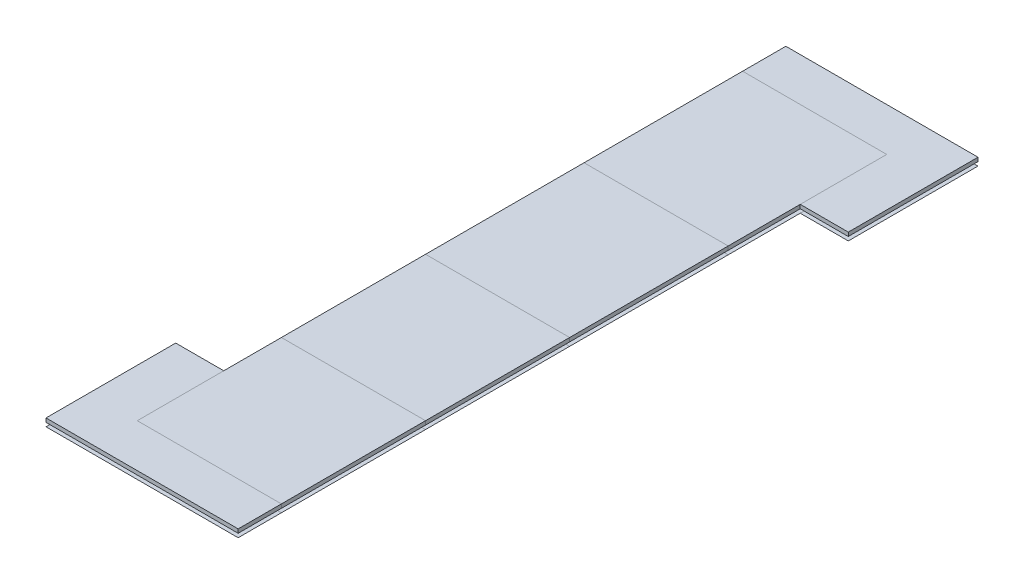
ISO-10303-21;
HEADER;
FILE_DESCRIPTION(('STEP AP214'),'2;1');
FILE_NAME('part.step','',(''),(''),'','','');
FILE_SCHEMA(('AUTOMOTIVE_DESIGN { 1 0 10303 214 1 1 1 1 }'));
ENDSEC;
DATA;
#1=APPLICATION_CONTEXT('core data for automotive mechanical design processes');
#2=APPLICATION_PROTOCOL_DEFINITION('international standard','automotive_design',2000,#1);
#3=PRODUCT_CONTEXT('',#1,'mechanical');
#4=PRODUCT('Part','Part','',(#3));
#5=PRODUCT_RELATED_PRODUCT_CATEGORY('part','',(#4));
#6=PRODUCT_DEFINITION_FORMATION('','',#4);
#7=PRODUCT_DEFINITION_CONTEXT('part definition',#1,'design');
#8=PRODUCT_DEFINITION('design','',#6,#7);
#9=PRODUCT_DEFINITION_SHAPE('','',#8);
#10=(LENGTH_UNIT() NAMED_UNIT(*) SI_UNIT(.MILLI.,.METRE.));
#11=(NAMED_UNIT(*) PLANE_ANGLE_UNIT() SI_UNIT($,.RADIAN.));
#12=(NAMED_UNIT(*) SI_UNIT($,.STERADIAN.) SOLID_ANGLE_UNIT());
#13=UNCERTAINTY_MEASURE_WITH_UNIT(LENGTH_MEASURE(1.E-05),#10,'distance_accuracy_value','');
#14=(GEOMETRIC_REPRESENTATION_CONTEXT(3) GLOBAL_UNCERTAINTY_ASSIGNED_CONTEXT((#13)) GLOBAL_UNIT_ASSIGNED_CONTEXT((#10,
#11,#12)) REPRESENTATION_CONTEXT('',''));
#15=CARTESIAN_POINT('',(0.,0.,0.));
#16=DIRECTION('',(0.,0.,1.));
#17=DIRECTION('',(1.,0.,0.));
#18=AXIS2_PLACEMENT_3D('',#15,#16,#17);
#19=CARTESIAN_POINT('',(50.,4.,0.));
#20=DIRECTION('',(-1.,0.,0.));
#21=DIRECTION('',(0.,0.,1.));
#22=AXIS2_PLACEMENT_3D('',#19,#20,#21);
#23=PLANE('',#22);
#24=DIRECTION('',(0.,1.,0.));
#25=VECTOR('',#24,1.);
#26=CARTESIAN_POINT('',(50.,4.,-510.));
#27=LINE('',#26,#25);
#28=CARTESIAN_POINT('',(50.,4.,-510.));
#29=VERTEX_POINT('',#28);
#30=CARTESIAN_POINT('',(50.,8.,-510.));
#31=VERTEX_POINT('',#30);
#32=EDGE_CURVE('E12',#29,#31,#27,.T.);
#33=ORIENTED_EDGE('',*,*,#32,.F.);
#34=DIRECTION('',(0.,0.,1.));
#35=VECTOR('',#34,1.);
#36=CARTESIAN_POINT('',(50.,4.,0.));
#37=LINE('',#36,#35);
#38=CARTESIAN_POINT('',(50.,4.,-345.));
#39=VERTEX_POINT('',#38);
#40=EDGE_CURVE('E104',#29,#39,#37,.T.);
#41=ORIENTED_EDGE('',*,*,#40,.T.);
#42=DIRECTION('',(0.,1.,0.));
#43=VECTOR('',#42,1.);
#44=CARTESIAN_POINT('',(50.,4.,-345.));
#45=LINE('',#44,#43);
#46=CARTESIAN_POINT('',(50.,8.,-345.));
#47=VERTEX_POINT('',#46);
#48=EDGE_CURVE('E59',#39,#47,#45,.T.);
#49=ORIENTED_EDGE('',*,*,#48,.T.);
#50=DIRECTION('',(0.,0.,1.));
#51=VECTOR('',#50,1.);
#52=CARTESIAN_POINT('',(50.,8.,0.));
#53=LINE('',#52,#51);
#54=EDGE_CURVE('E117',#31,#47,#53,.T.);
#55=ORIENTED_EDGE('',*,*,#54,.F.);
#56=EDGE_LOOP('',(#33,#41,#49,#55));
#57=FACE_BOUND('',#56,.T.);
#58=ADVANCED_FACE('F49',(#57),#23,.T.);
#59=CARTESIAN_POINT('',(0.,4.,-345.));
#60=DIRECTION('',(0.,0.,1.));
#61=DIRECTION('',(1.,0.,0.));
#62=AXIS2_PLACEMENT_3D('',#59,#60,#61);
#63=PLANE('',#62);
#64=ORIENTED_EDGE('',*,*,#48,.F.);
#65=DIRECTION('',(1.,0.,0.));
#66=VECTOR('',#65,1.);
#67=CARTESIAN_POINT('',(0.,4.,-345.));
#68=LINE('',#67,#66);
#69=CARTESIAN_POINT('',(200.,4.,-345.));
#70=VERTEX_POINT('',#69);
#71=EDGE_CURVE('E111',#70,#39,#68,.F.);
#72=ORIENTED_EDGE('',*,*,#71,.F.);
#73=DIRECTION('',(0.,1.,0.));
#74=VECTOR('',#73,1.);
#75=CARTESIAN_POINT('',(200.,4.,-345.));
#76=LINE('',#75,#74);
#77=CARTESIAN_POINT('',(200.,8.,-345.));
#78=VERTEX_POINT('',#77);
#79=EDGE_CURVE('E67',#70,#78,#76,.T.);
#80=ORIENTED_EDGE('',*,*,#79,.T.);
#81=DIRECTION('',(1.,0.,0.));
#82=VECTOR('',#81,1.);
#83=CARTESIAN_POINT('',(0.,8.,-345.));
#84=LINE('',#83,#82);
#85=EDGE_CURVE('E98',#78,#47,#84,.F.);
#86=ORIENTED_EDGE('',*,*,#85,.T.);
#87=EDGE_LOOP('',(#64,#72,#80,#86));
#88=FACE_BOUND('',#87,.T.);
#89=ADVANCED_FACE('F121',(#88),#63,.T.);
#90=CARTESIAN_POINT('',(200.,4.,0.));
#91=DIRECTION('',(-1.,0.,0.));
#92=DIRECTION('',(0.,0.,1.));
#93=AXIS2_PLACEMENT_3D('',#90,#91,#92);
#94=PLANE('',#93);
#95=ORIENTED_EDGE('',*,*,#79,.F.);
#96=DIRECTION('',(0.,0.,1.));
#97=VECTOR('',#96,1.);
#98=CARTESIAN_POINT('',(200.,4.,0.));
#99=LINE('',#98,#97);
#100=CARTESIAN_POINT('',(200.,4.,-510.));
#101=VERTEX_POINT('',#100);
#102=EDGE_CURVE('E103',#70,#101,#99,.F.);
#103=ORIENTED_EDGE('',*,*,#102,.T.);
#104=DIRECTION('',(0.,1.,0.));
#105=VECTOR('',#104,1.);
#106=CARTESIAN_POINT('',(200.,4.,-510.));
#107=LINE('',#106,#105);
#108=CARTESIAN_POINT('',(200.,8.,-510.));
#109=VERTEX_POINT('',#108);
#110=EDGE_CURVE('E53',#101,#109,#107,.T.);
#111=ORIENTED_EDGE('',*,*,#110,.T.);
#112=DIRECTION('',(0.,0.,1.));
#113=VECTOR('',#112,1.);
#114=CARTESIAN_POINT('',(200.,8.,0.));
#115=LINE('',#114,#113);
#116=EDGE_CURVE('E113',#78,#109,#115,.F.);
#117=ORIENTED_EDGE('',*,*,#116,.F.);
#118=EDGE_LOOP('',(#95,#103,#111,#117));
#119=FACE_BOUND('',#118,.T.);
#120=ADVANCED_FACE('F106',(#119),#94,.F.);
#121=CARTESIAN_POINT('',(0.,4.,-510.));
#122=DIRECTION('',(0.,0.,1.));
#123=DIRECTION('',(1.,0.,0.));
#124=AXIS2_PLACEMENT_3D('',#121,#122,#123);
#125=PLANE('',#124);
#126=DIRECTION('',(1.,0.,0.));
#127=VECTOR('',#126,1.);
#128=CARTESIAN_POINT('',(0.,4.,-510.));
#129=LINE('',#128,#127);
#130=EDGE_CURVE('E92',#101,#29,#129,.F.);
#131=ORIENTED_EDGE('',*,*,#130,.T.);
#132=ORIENTED_EDGE('',*,*,#32,.T.);
#133=DIRECTION('',(1.,0.,0.));
#134=VECTOR('',#133,1.);
#135=CARTESIAN_POINT('',(0.,8.,-510.));
#136=LINE('',#135,#134);
#137=EDGE_CURVE('E94',#109,#31,#136,.F.);
#138=ORIENTED_EDGE('',*,*,#137,.F.);
#139=ORIENTED_EDGE('',*,*,#110,.F.);
#140=EDGE_LOOP('',(#131,#132,#138,#139));
#141=FACE_BOUND('',#140,.T.);
#142=ADVANCED_FACE('F51',(#141),#125,.F.);
#143=CARTESIAN_POINT('',(0.,8.,0.));
#144=DIRECTION('',(0.,1.,0.));
#145=DIRECTION('',(0.,0.,1.));
#146=AXIS2_PLACEMENT_3D('',#143,#144,#145);
#147=PLANE('',#146);
#148=ORIENTED_EDGE('',*,*,#116,.T.);
#149=ORIENTED_EDGE('',*,*,#137,.T.);
#150=ORIENTED_EDGE('',*,*,#54,.T.);
#151=ORIENTED_EDGE('',*,*,#85,.F.);
#152=EDGE_LOOP('',(#148,#149,#150,#151));
#153=FACE_BOUND('',#152,.T.);
#154=ADVANCED_FACE('F120',(#153),#147,.T.);
#155=CARTESIAN_POINT('',(0.,4.,0.));
#156=DIRECTION('',(0.,1.,0.));
#157=DIRECTION('',(0.,0.,1.));
#158=AXIS2_PLACEMENT_3D('',#155,#156,#157);
#159=PLANE('',#158);
#160=ORIENTED_EDGE('',*,*,#102,.F.);
#161=ORIENTED_EDGE('',*,*,#71,.T.);
#162=ORIENTED_EDGE('',*,*,#40,.F.);
#163=ORIENTED_EDGE('',*,*,#130,.F.);
#164=EDGE_LOOP('',(#160,#161,#162,#163));
#165=FACE_BOUND('',#164,.T.);
#166=ADVANCED_FACE('F101',(#165),#159,.F.);
#167=CLOSED_SHELL('',(#58,#89,#120,#142,#154,#166));
#168=MANIFOLD_SOLID_BREP('B2',#167);
#169=CARTESIAN_POINT('',(0.,4.,-585.));
#170=DIRECTION('',(0.,0.,1.));
#171=DIRECTION('',(1.,0.,0.));
#172=AXIS2_PLACEMENT_3D('',#169,#170,#171);
#173=PLANE('',#172);
#174=DIRECTION('',(0.,1.,0.));
#175=VECTOR('',#174,1.);
#176=CARTESIAN_POINT('',(200.,4.,-585.));
#177=LINE('',#176,#175);
#178=CARTESIAN_POINT('',(200.,4.,-585.));
#179=VERTEX_POINT('',#178);
#180=CARTESIAN_POINT('',(200.,8.,-585.));
#181=VERTEX_POINT('',#180);
#182=EDGE_CURVE('E47',#179,#181,#177,.T.);
#183=ORIENTED_EDGE('',*,*,#182,.F.);
#184=DIRECTION('',(1.,0.,0.));
#185=VECTOR('',#184,1.);
#186=CARTESIAN_POINT('',(0.,4.,-585.));
#187=LINE('',#186,#185);
#188=CARTESIAN_POINT('',(250.,4.,-585.));
#189=VERTEX_POINT('',#188);
#190=EDGE_CURVE('E250',#179,#189,#187,.T.);
#191=ORIENTED_EDGE('',*,*,#190,.T.);
#192=DIRECTION('',(0.,1.,0.));
#193=VECTOR('',#192,1.);
#194=CARTESIAN_POINT('',(250.,4.,-585.));
#195=LINE('',#194,#193);
#196=CARTESIAN_POINT('',(250.,8.,-585.));
#197=VERTEX_POINT('',#196);
#198=EDGE_CURVE('E192',#189,#197,#195,.T.);
#199=ORIENTED_EDGE('',*,*,#198,.T.);
#200=DIRECTION('',(1.,0.,0.));
#201=VECTOR('',#200,1.);
#202=CARTESIAN_POINT('',(0.,8.,-585.));
#203=LINE('',#202,#201);
#204=EDGE_CURVE('E273',#181,#197,#203,.T.);
#205=ORIENTED_EDGE('',*,*,#204,.F.);
#206=EDGE_LOOP('',(#183,#191,#199,#205));
#207=FACE_BOUND('',#206,.T.);
#208=ADVANCED_FACE('F182',(#207),#173,.T.);
#209=CARTESIAN_POINT('',(250.,4.,0.));
#210=DIRECTION('',(-1.,0.,0.));
#211=DIRECTION('',(0.,0.,1.));
#212=AXIS2_PLACEMENT_3D('',#209,#210,#211);
#213=PLANE('',#212);
#214=ORIENTED_EDGE('',*,*,#198,.F.);
#215=DIRECTION('',(0.,0.,1.));
#216=VECTOR('',#215,1.);
#217=CARTESIAN_POINT('',(250.,4.,0.));
#218=LINE('',#217,#216);
#219=CARTESIAN_POINT('',(250.,4.,-720.));
#220=VERTEX_POINT('',#219);
#221=EDGE_CURVE('E263',#189,#220,#218,.F.);
#222=ORIENTED_EDGE('',*,*,#221,.T.);
#223=DIRECTION('',(0.,1.,0.));
#224=VECTOR('',#223,1.);
#225=CARTESIAN_POINT('',(250.,4.,-720.));
#226=LINE('',#225,#224);
#227=CARTESIAN_POINT('',(250.,8.,-720.));
#228=VERTEX_POINT('',#227);
#229=EDGE_CURVE('E270',#220,#228,#226,.T.);
#230=ORIENTED_EDGE('',*,*,#229,.T.);
#231=DIRECTION('',(0.,0.,1.));
#232=VECTOR('',#231,1.);
#233=CARTESIAN_POINT('',(250.,8.,0.));
#234=LINE('',#233,#232);
#235=EDGE_CURVE('E280',#197,#228,#234,.F.);
#236=ORIENTED_EDGE('',*,*,#235,.F.);
#237=EDGE_LOOP('',(#214,#222,#230,#236));
#238=FACE_BOUND('',#237,.T.);
#239=ADVANCED_FACE('F282',(#238),#213,.F.);
#240=CARTESIAN_POINT('',(0.,4.,-720.));
#241=DIRECTION('',(0.,0.,1.));
#242=DIRECTION('',(1.,0.,0.));
#243=AXIS2_PLACEMENT_3D('',#240,#241,#242);
#244=PLANE('',#243);
#245=ORIENTED_EDGE('',*,*,#229,.F.);
#246=DIRECTION('',(1.,0.,0.));
#247=VECTOR('',#246,1.);
#248=CARTESIAN_POINT('',(0.,4.,-720.));
#249=LINE('',#248,#247);
#250=CARTESIAN_POINT('',(50.0000000000001,4.,-720.));
#251=VERTEX_POINT('',#250);
#252=EDGE_CURVE('E260',#220,#251,#249,.F.);
#253=ORIENTED_EDGE('',*,*,#252,.T.);
#254=DIRECTION('',(0.,1.,0.));
#255=VECTOR('',#254,1.);
#256=CARTESIAN_POINT('',(50.0000000000001,4.,-720.));
#257=LINE('',#256,#255);
#258=CARTESIAN_POINT('',(50.0000000000001,8.,-720.));
#259=VERTEX_POINT('',#258);
#260=EDGE_CURVE('E268',#251,#259,#257,.T.);
#261=ORIENTED_EDGE('',*,*,#260,.T.);
#262=DIRECTION('',(1.,0.,0.));
#263=VECTOR('',#262,1.);
#264=CARTESIAN_POINT('',(0.,8.,-720.));
#265=LINE('',#264,#263);
#266=EDGE_CURVE('E283',#228,#259,#265,.F.);
#267=ORIENTED_EDGE('',*,*,#266,.F.);
#268=EDGE_LOOP('',(#245,#253,#261,#267));
#269=FACE_BOUND('',#268,.T.);
#270=ADVANCED_FACE('F292',(#269),#244,.F.);
#271=CARTESIAN_POINT('',(50.0000000000001,4.,0.));
#272=DIRECTION('',(-1.,0.,0.));
#273=DIRECTION('',(0.,0.,1.));
#274=AXIS2_PLACEMENT_3D('',#271,#272,#273);
#275=PLANE('',#274);
#276=ORIENTED_EDGE('',*,*,#260,.F.);
#277=DIRECTION('',(0.,0.,1.));
#278=VECTOR('',#277,1.);
#279=CARTESIAN_POINT('',(50.0000000000001,4.,0.));
#280=LINE('',#279,#278);
#281=CARTESIAN_POINT('',(50.0000000000001,4.,-675.));
#282=VERTEX_POINT('',#281);
#283=EDGE_CURVE('E257',#251,#282,#280,.T.);
#284=ORIENTED_EDGE('',*,*,#283,.T.);
#285=DIRECTION('',(0.,1.,0.));
#286=VECTOR('',#285,1.);
#287=CARTESIAN_POINT('',(50.0000000000001,4.,-675.));
#288=LINE('',#287,#286);
#289=CARTESIAN_POINT('',(50.0000000000001,8.,-675.));
#290=VERTEX_POINT('',#289);
#291=EDGE_CURVE('E200',#282,#290,#288,.T.);
#292=ORIENTED_EDGE('',*,*,#291,.T.);
#293=DIRECTION('',(0.,0.,1.));
#294=VECTOR('',#293,1.);
#295=CARTESIAN_POINT('',(50.0000000000001,8.,0.));
#296=LINE('',#295,#294);
#297=EDGE_CURVE('E243',#259,#290,#296,.T.);
#298=ORIENTED_EDGE('',*,*,#297,.F.);
#299=EDGE_LOOP('',(#276,#284,#292,#298));
#300=FACE_BOUND('',#299,.T.);
#301=ADVANCED_FACE('F289',(#300),#275,.T.);
#302=CARTESIAN_POINT('',(0.,4.,-675.));
#303=DIRECTION('',(0.,0.,1.));
#304=DIRECTION('',(1.,0.,0.));
#305=AXIS2_PLACEMENT_3D('',#302,#303,#304);
#306=PLANE('',#305);
#307=ORIENTED_EDGE('',*,*,#291,.F.);
#308=DIRECTION('',(1.,0.,0.));
#309=VECTOR('',#308,1.);
#310=CARTESIAN_POINT('',(0.,4.,-675.));
#311=LINE('',#310,#309);
#312=CARTESIAN_POINT('',(200.,4.,-675.));
#313=VERTEX_POINT('',#312);
#314=EDGE_CURVE('E248',#282,#313,#311,.T.);
#315=ORIENTED_EDGE('',*,*,#314,.T.);
#316=DIRECTION('',(0.,1.,0.));
#317=VECTOR('',#316,1.);
#318=CARTESIAN_POINT('',(200.,4.,-675.));
#319=LINE('',#318,#317);
#320=CARTESIAN_POINT('',(200.,8.,-675.));
#321=VERTEX_POINT('',#320);
#322=EDGE_CURVE('E186',#313,#321,#319,.T.);
#323=ORIENTED_EDGE('',*,*,#322,.T.);
#324=DIRECTION('',(1.,0.,0.));
#325=VECTOR('',#324,1.);
#326=CARTESIAN_POINT('',(0.,8.,-675.));
#327=LINE('',#326,#325);
#328=EDGE_CURVE('E259',#290,#321,#327,.T.);
#329=ORIENTED_EDGE('',*,*,#328,.F.);
#330=EDGE_LOOP('',(#307,#315,#323,#329));
#331=FACE_BOUND('',#330,.T.);
#332=ADVANCED_FACE('F252',(#331),#306,.T.);
#333=CARTESIAN_POINT('',(200.,4.,0.));
#334=DIRECTION('',(-1.,0.,0.));
#335=DIRECTION('',(0.,0.,1.));
#336=AXIS2_PLACEMENT_3D('',#333,#334,#335);
#337=PLANE('',#336);
#338=DIRECTION('',(0.,0.,1.));
#339=VECTOR('',#338,1.);
#340=CARTESIAN_POINT('',(200.,4.,0.));
#341=LINE('',#340,#339);
#342=EDGE_CURVE('E237',#313,#179,#341,.T.);
#343=ORIENTED_EDGE('',*,*,#342,.T.);
#344=ORIENTED_EDGE('',*,*,#182,.T.);
#345=DIRECTION('',(0.,0.,1.));
#346=VECTOR('',#345,1.);
#347=CARTESIAN_POINT('',(200.,8.,0.));
#348=LINE('',#347,#346);
#349=EDGE_CURVE('E239',#321,#181,#348,.T.);
#350=ORIENTED_EDGE('',*,*,#349,.F.);
#351=ORIENTED_EDGE('',*,*,#322,.F.);
#352=EDGE_LOOP('',(#343,#344,#350,#351));
#353=FACE_BOUND('',#352,.T.);
#354=ADVANCED_FACE('F184',(#353),#337,.T.);
#355=CARTESIAN_POINT('',(0.,8.,0.));
#356=DIRECTION('',(0.,1.,0.));
#357=DIRECTION('',(0.,0.,1.));
#358=AXIS2_PLACEMENT_3D('',#355,#356,#357);
#359=PLANE('',#358);
#360=ORIENTED_EDGE('',*,*,#328,.T.);
#361=ORIENTED_EDGE('',*,*,#349,.T.);
#362=ORIENTED_EDGE('',*,*,#204,.T.);
#363=ORIENTED_EDGE('',*,*,#235,.T.);
#364=ORIENTED_EDGE('',*,*,#266,.T.);
#365=ORIENTED_EDGE('',*,*,#297,.T.);
#366=EDGE_LOOP('',(#360,#361,#362,#363,#364,#365));
#367=FACE_BOUND('',#366,.T.);
#368=ADVANCED_FACE('F278',(#367),#359,.T.);
#369=CARTESIAN_POINT('',(0.,4.,0.));
#370=DIRECTION('',(0.,1.,0.));
#371=DIRECTION('',(0.,0.,1.));
#372=AXIS2_PLACEMENT_3D('',#369,#370,#371);
#373=PLANE('',#372);
#374=ORIENTED_EDGE('',*,*,#314,.F.);
#375=ORIENTED_EDGE('',*,*,#283,.F.);
#376=ORIENTED_EDGE('',*,*,#252,.F.);
#377=ORIENTED_EDGE('',*,*,#221,.F.);
#378=ORIENTED_EDGE('',*,*,#190,.F.);
#379=ORIENTED_EDGE('',*,*,#342,.F.);
#380=EDGE_LOOP('',(#374,#375,#376,#377,#378,#379));
#381=FACE_BOUND('',#380,.T.);
#382=ADVANCED_FACE('F246',(#381),#373,.F.);
#383=CLOSED_SHELL('',(#208,#239,#270,#301,#332,#354,#368,#382));
#384=MANIFOLD_SOLID_BREP('B6',#383);
#385=CARTESIAN_POINT('',(0.,4.,-135.));
#386=DIRECTION('',(0.,0.,1.));
#387=DIRECTION('',(1.,0.,0.));
#388=AXIS2_PLACEMENT_3D('',#385,#386,#387);
#389=PLANE('',#388);
#390=DIRECTION('',(0.,1.,0.));
#391=VECTOR('',#390,1.);
#392=CARTESIAN_POINT('',(50.,4.,-135.));
#393=LINE('',#392,#391);
#394=CARTESIAN_POINT('',(50.,4.,-135.));
#395=VERTEX_POINT('',#394);
#396=CARTESIAN_POINT('',(50.,8.,-135.));
#397=VERTEX_POINT('',#396);
#398=EDGE_CURVE('E180',#395,#397,#393,.T.);
#399=ORIENTED_EDGE('',*,*,#398,.F.);
#400=DIRECTION('',(1.,0.,0.));
#401=VECTOR('',#400,1.);
#402=CARTESIAN_POINT('',(0.,4.,-135.));
#403=LINE('',#402,#401);
#404=CARTESIAN_POINT('',(0.,4.,-135.));
#405=VERTEX_POINT('',#404);
#406=EDGE_CURVE('E435',#395,#405,#403,.F.);
#407=ORIENTED_EDGE('',*,*,#406,.T.);
#408=DIRECTION('',(0.,1.,0.));
#409=VECTOR('',#408,1.);
#410=CARTESIAN_POINT('',(0.,4.,-135.));
#411=LINE('',#410,#409);
#412=CARTESIAN_POINT('',(0.,8.,-135.));
#413=VERTEX_POINT('',#412);
#414=EDGE_CURVE('E377',#405,#413,#411,.T.);
#415=ORIENTED_EDGE('',*,*,#414,.T.);
#416=DIRECTION('',(1.,0.,0.));
#417=VECTOR('',#416,1.);
#418=CARTESIAN_POINT('',(0.,8.,-135.));
#419=LINE('',#418,#417);
#420=EDGE_CURVE('E458',#397,#413,#419,.F.);
#421=ORIENTED_EDGE('',*,*,#420,.F.);
#422=EDGE_LOOP('',(#399,#407,#415,#421));
#423=FACE_BOUND('',#422,.T.);
#424=ADVANCED_FACE('F367',(#423),#389,.F.);
#425=CARTESIAN_POINT('',(0.,4.,0.));
#426=DIRECTION('',(-1.,0.,0.));
#427=DIRECTION('',(0.,0.,1.));
#428=AXIS2_PLACEMENT_3D('',#425,#426,#427);
#429=PLANE('',#428);
#430=ORIENTED_EDGE('',*,*,#414,.F.);
#431=DIRECTION('',(0.,0.,1.));
#432=VECTOR('',#431,1.);
#433=CARTESIAN_POINT('',(0.,4.,0.));
#434=LINE('',#433,#432);
#435=CARTESIAN_POINT('',(0.,4.,0.));
#436=VERTEX_POINT('',#435);
#437=EDGE_CURVE('E448',#405,#436,#434,.T.);
#438=ORIENTED_EDGE('',*,*,#437,.T.);
#439=DIRECTION('',(0.,1.,0.));
#440=VECTOR('',#439,1.);
#441=CARTESIAN_POINT('',(0.,4.,0.));
#442=LINE('',#441,#440);
#443=CARTESIAN_POINT('',(0.,8.,0.));
#444=VERTEX_POINT('',#443);
#445=EDGE_CURVE('E455',#436,#444,#442,.T.);
#446=ORIENTED_EDGE('',*,*,#445,.T.);
#447=DIRECTION('',(0.,0.,1.));
#448=VECTOR('',#447,1.);
#449=CARTESIAN_POINT('',(0.,8.,0.));
#450=LINE('',#449,#448);
#451=EDGE_CURVE('E465',#413,#444,#450,.T.);
#452=ORIENTED_EDGE('',*,*,#451,.F.);
#453=EDGE_LOOP('',(#430,#438,#446,#452));
#454=FACE_BOUND('',#453,.T.);
#455=ADVANCED_FACE('F467',(#454),#429,.T.);
#456=CARTESIAN_POINT('',(0.,4.,0.));
#457=DIRECTION('',(0.,0.,1.));
#458=DIRECTION('',(1.,0.,0.));
#459=AXIS2_PLACEMENT_3D('',#456,#457,#458);
#460=PLANE('',#459);
#461=ORIENTED_EDGE('',*,*,#445,.F.);
#462=DIRECTION('',(1.,0.,0.));
#463=VECTOR('',#462,1.);
#464=CARTESIAN_POINT('',(0.,4.,0.));
#465=LINE('',#464,#463);
#466=CARTESIAN_POINT('',(200.,4.,0.));
#467=VERTEX_POINT('',#466);
#468=EDGE_CURVE('E445',#436,#467,#465,.T.);
#469=ORIENTED_EDGE('',*,*,#468,.T.);
#470=DIRECTION('',(0.,1.,0.));
#471=VECTOR('',#470,1.);
#472=CARTESIAN_POINT('',(200.,4.,0.));
#473=LINE('',#472,#471);
#474=CARTESIAN_POINT('',(200.,8.,0.));
#475=VERTEX_POINT('',#474);
#476=EDGE_CURVE('E453',#467,#475,#473,.T.);
#477=ORIENTED_EDGE('',*,*,#476,.T.);
#478=DIRECTION('',(1.,0.,0.));
#479=VECTOR('',#478,1.);
#480=CARTESIAN_POINT('',(0.,8.,0.));
#481=LINE('',#480,#479);
#482=EDGE_CURVE('E468',#444,#475,#481,.T.);
#483=ORIENTED_EDGE('',*,*,#482,.F.);
#484=EDGE_LOOP('',(#461,#469,#477,#483));
#485=FACE_BOUND('',#484,.T.);
#486=ADVANCED_FACE('F477',(#485),#460,.T.);
#487=CARTESIAN_POINT('',(200.,4.,0.));
#488=DIRECTION('',(-1.,0.,0.));
#489=DIRECTION('',(0.,0.,1.));
#490=AXIS2_PLACEMENT_3D('',#487,#488,#489);
#491=PLANE('',#490);
#492=ORIENTED_EDGE('',*,*,#476,.F.);
#493=DIRECTION('',(0.,0.,1.));
#494=VECTOR('',#493,1.);
#495=CARTESIAN_POINT('',(200.,4.,0.));
#496=LINE('',#495,#494);
#497=CARTESIAN_POINT('',(200.,4.,-45.0000000000001));
#498=VERTEX_POINT('',#497);
#499=EDGE_CURVE('E442',#467,#498,#496,.F.);
#500=ORIENTED_EDGE('',*,*,#499,.T.);
#501=DIRECTION('',(0.,1.,0.));
#502=VECTOR('',#501,1.);
#503=CARTESIAN_POINT('',(200.,4.,-45.0000000000001));
#504=LINE('',#503,#502);
#505=CARTESIAN_POINT('',(200.,8.,-45.0000000000001));
#506=VERTEX_POINT('',#505);
#507=EDGE_CURVE('E385',#498,#506,#504,.T.);
#508=ORIENTED_EDGE('',*,*,#507,.T.);
#509=DIRECTION('',(0.,0.,1.));
#510=VECTOR('',#509,1.);
#511=CARTESIAN_POINT('',(200.,8.,0.));
#512=LINE('',#511,#510);
#513=EDGE_CURVE('E428',#475,#506,#512,.F.);
#514=ORIENTED_EDGE('',*,*,#513,.F.);
#515=EDGE_LOOP('',(#492,#500,#508,#514));
#516=FACE_BOUND('',#515,.T.);
#517=ADVANCED_FACE('F474',(#516),#491,.F.);
#518=CARTESIAN_POINT('',(0.,4.,-45.0000000000001));
#519=DIRECTION('',(0.,0.,1.));
#520=DIRECTION('',(1.,0.,0.));
#521=AXIS2_PLACEMENT_3D('',#518,#519,#520);
#522=PLANE('',#521);
#523=ORIENTED_EDGE('',*,*,#507,.F.);
#524=DIRECTION('',(1.,0.,0.));
#525=VECTOR('',#524,1.);
#526=CARTESIAN_POINT('',(0.,4.,-45.0000000000001));
#527=LINE('',#526,#525);
#528=CARTESIAN_POINT('',(50.0000000000001,4.,-45.0000000000001));
#529=VERTEX_POINT('',#528);
#530=EDGE_CURVE('E433',#498,#529,#527,.F.);
#531=ORIENTED_EDGE('',*,*,#530,.T.);
#532=DIRECTION('',(0.,1.,0.));
#533=VECTOR('',#532,1.);
#534=CARTESIAN_POINT('',(50.0000000000001,4.,-45.0000000000001));
#535=LINE('',#534,#533);
#536=CARTESIAN_POINT('',(50.0000000000001,8.,-45.0000000000001));
#537=VERTEX_POINT('',#536);
#538=EDGE_CURVE('E371',#529,#537,#535,.T.);
#539=ORIENTED_EDGE('',*,*,#538,.T.);
#540=DIRECTION('',(1.,0.,0.));
#541=VECTOR('',#540,1.);
#542=CARTESIAN_POINT('',(0.,8.,-45.0000000000001));
#543=LINE('',#542,#541);
#544=EDGE_CURVE('E444',#506,#537,#543,.F.);
#545=ORIENTED_EDGE('',*,*,#544,.F.);
#546=EDGE_LOOP('',(#523,#531,#539,#545));
#547=FACE_BOUND('',#546,.T.);
#548=ADVANCED_FACE('F437',(#547),#522,.F.);
#549=CARTESIAN_POINT('',(50.0000000000001,4.,0.));
#550=DIRECTION('',(-1.,0.,0.));
#551=DIRECTION('',(0.,0.,1.));
#552=AXIS2_PLACEMENT_3D('',#549,#550,#551);
#553=PLANE('',#552);
#554=DIRECTION('',(0.,0.,1.));
#555=VECTOR('',#554,1.);
#556=CARTESIAN_POINT('',(50.0000000000001,4.,0.));
#557=LINE('',#556,#555);
#558=EDGE_CURVE('E422',#529,#395,#557,.F.);
#559=ORIENTED_EDGE('',*,*,#558,.T.);
#560=ORIENTED_EDGE('',*,*,#398,.T.);
#561=DIRECTION('',(0.,0.,1.));
#562=VECTOR('',#561,1.);
#563=CARTESIAN_POINT('',(50.0000000000001,8.,0.));
#564=LINE('',#563,#562);
#565=EDGE_CURVE('E424',#537,#397,#564,.F.);
#566=ORIENTED_EDGE('',*,*,#565,.F.);
#567=ORIENTED_EDGE('',*,*,#538,.F.);
#568=EDGE_LOOP('',(#559,#560,#566,#567));
#569=FACE_BOUND('',#568,.T.);
#570=ADVANCED_FACE('F369',(#569),#553,.F.);
#571=CARTESIAN_POINT('',(0.,8.,0.));
#572=DIRECTION('',(0.,1.,0.));
#573=DIRECTION('',(0.,0.,1.));
#574=AXIS2_PLACEMENT_3D('',#571,#572,#573);
#575=PLANE('',#574);
#576=ORIENTED_EDGE('',*,*,#544,.T.);
#577=ORIENTED_EDGE('',*,*,#565,.T.);
#578=ORIENTED_EDGE('',*,*,#420,.T.);
#579=ORIENTED_EDGE('',*,*,#451,.T.);
#580=ORIENTED_EDGE('',*,*,#482,.T.);
#581=ORIENTED_EDGE('',*,*,#513,.T.);
#582=EDGE_LOOP('',(#576,#577,#578,#579,#580,#581));
#583=FACE_BOUND('',#582,.T.);
#584=ADVANCED_FACE('F463',(#583),#575,.T.);
#585=CARTESIAN_POINT('',(0.,4.,0.));
#586=DIRECTION('',(0.,1.,0.));
#587=DIRECTION('',(0.,0.,1.));
#588=AXIS2_PLACEMENT_3D('',#585,#586,#587);
#589=PLANE('',#588);
#590=ORIENTED_EDGE('',*,*,#530,.F.);
#591=ORIENTED_EDGE('',*,*,#499,.F.);
#592=ORIENTED_EDGE('',*,*,#468,.F.);
#593=ORIENTED_EDGE('',*,*,#437,.F.);
#594=ORIENTED_EDGE('',*,*,#406,.F.);
#595=ORIENTED_EDGE('',*,*,#558,.F.);
#596=EDGE_LOOP('',(#590,#591,#592,#593,#594,#595));
#597=FACE_BOUND('',#596,.T.);
#598=ADVANCED_FACE('F431',(#597),#589,.F.);
#599=CLOSED_SHELL('',(#424,#455,#486,#517,#548,#570,#584,#598));
#600=MANIFOLD_SOLID_BREP('B41',#599);
#601=CARTESIAN_POINT('',(50.,4.,0.));
#602=DIRECTION('',(-1.,0.,0.));
#603=DIRECTION('',(0.,0.,1.));
#604=AXIS2_PLACEMENT_3D('',#601,#602,#603);
#605=PLANE('',#604);
#606=DIRECTION('',(0.,1.,0.));
#607=VECTOR('',#606,1.);
#608=CARTESIAN_POINT('',(50.,4.,-195.));
#609=LINE('',#608,#607);
#610=CARTESIAN_POINT('',(50.,4.,-195.));
#611=VERTEX_POINT('',#610);
#612=CARTESIAN_POINT('',(50.,8.,-195.));
#613=VERTEX_POINT('',#612);
#614=EDGE_CURVE('E365',#611,#613,#609,.T.);
#615=ORIENTED_EDGE('',*,*,#614,.F.);
#616=DIRECTION('',(0.,0.,1.));
#617=VECTOR('',#616,1.);
#618=CARTESIAN_POINT('',(50.,4.,0.));
#619=LINE('',#618,#617);
#620=CARTESIAN_POINT('',(50.0000000000001,4.,-45.0000000000001));
#621=VERTEX_POINT('',#620);
#622=EDGE_CURVE('E607',#611,#621,#619,.T.);
#623=ORIENTED_EDGE('',*,*,#622,.T.);
#624=DIRECTION('',(0.,1.,0.));
#625=VECTOR('',#624,1.);
#626=CARTESIAN_POINT('',(50.0000000000001,4.,-45.0000000000001));
#627=LINE('',#626,#625);
#628=CARTESIAN_POINT('',(50.0000000000001,8.,-45.0000000000001));
#629=VERTEX_POINT('',#628);
#630=EDGE_CURVE('E562',#621,#629,#627,.T.);
#631=ORIENTED_EDGE('',*,*,#630,.T.);
#632=DIRECTION('',(0.,0.,1.));
#633=VECTOR('',#632,1.);
#634=CARTESIAN_POINT('',(50.,8.,0.));
#635=LINE('',#634,#633);
#636=EDGE_CURVE('E620',#613,#629,#635,.T.);
#637=ORIENTED_EDGE('',*,*,#636,.F.);
#638=EDGE_LOOP('',(#615,#623,#631,#637));
#639=FACE_BOUND('',#638,.T.);
#640=ADVANCED_FACE('F552',(#639),#605,.T.);
#641=CARTESIAN_POINT('',(0.,4.,-45.0000000000001));
#642=DIRECTION('',(0.,0.,1.));
#643=DIRECTION('',(1.,0.,0.));
#644=AXIS2_PLACEMENT_3D('',#641,#642,#643);
#645=PLANE('',#644);
#646=ORIENTED_EDGE('',*,*,#630,.F.);
#647=DIRECTION('',(1.,0.,0.));
#648=VECTOR('',#647,1.);
#649=CARTESIAN_POINT('',(0.,4.,-45.0000000000001));
#650=LINE('',#649,#648);
#651=CARTESIAN_POINT('',(200.,4.,-45.0000000000001));
#652=VERTEX_POINT('',#651);
#653=EDGE_CURVE('E614',#652,#621,#650,.F.);
#654=ORIENTED_EDGE('',*,*,#653,.F.);
#655=DIRECTION('',(0.,1.,0.));
#656=VECTOR('',#655,1.);
#657=CARTESIAN_POINT('',(200.,4.,-45.0000000000001));
#658=LINE('',#657,#656);
#659=CARTESIAN_POINT('',(200.,8.,-45.0000000000001));
#660=VERTEX_POINT('',#659);
#661=EDGE_CURVE('E570',#652,#660,#658,.T.);
#662=ORIENTED_EDGE('',*,*,#661,.T.);
#663=DIRECTION('',(1.,0.,0.));
#664=VECTOR('',#663,1.);
#665=CARTESIAN_POINT('',(0.,8.,-45.0000000000001));
#666=LINE('',#665,#664);
#667=EDGE_CURVE('E601',#660,#629,#666,.F.);
#668=ORIENTED_EDGE('',*,*,#667,.T.);
#669=EDGE_LOOP('',(#646,#654,#662,#668));
#670=FACE_BOUND('',#669,.T.);
#671=ADVANCED_FACE('F624',(#670),#645,.T.);
#672=CARTESIAN_POINT('',(200.,4.,0.));
#673=DIRECTION('',(-1.,0.,0.));
#674=DIRECTION('',(0.,0.,1.));
#675=AXIS2_PLACEMENT_3D('',#672,#673,#674);
#676=PLANE('',#675);
#677=ORIENTED_EDGE('',*,*,#661,.F.);
#678=DIRECTION('',(0.,0.,1.));
#679=VECTOR('',#678,1.);
#680=CARTESIAN_POINT('',(200.,4.,0.));
#681=LINE('',#680,#679);
#682=CARTESIAN_POINT('',(200.,4.,-195.));
#683=VERTEX_POINT('',#682);
#684=EDGE_CURVE('E606',#652,#683,#681,.F.);
#685=ORIENTED_EDGE('',*,*,#684,.T.);
#686=DIRECTION('',(0.,1.,0.));
#687=VECTOR('',#686,1.);
#688=CARTESIAN_POINT('',(200.,4.,-195.));
#689=LINE('',#688,#687);
#690=CARTESIAN_POINT('',(200.,8.,-195.));
#691=VERTEX_POINT('',#690);
#692=EDGE_CURVE('E556',#683,#691,#689,.T.);
#693=ORIENTED_EDGE('',*,*,#692,.T.);
#694=DIRECTION('',(0.,0.,1.));
#695=VECTOR('',#694,1.);
#696=CARTESIAN_POINT('',(200.,8.,0.));
#697=LINE('',#696,#695);
#698=EDGE_CURVE('E616',#660,#691,#697,.F.);
#699=ORIENTED_EDGE('',*,*,#698,.F.);
#700=EDGE_LOOP('',(#677,#685,#693,#699));
#701=FACE_BOUND('',#700,.T.);
#702=ADVANCED_FACE('F609',(#701),#676,.F.);
#703=CARTESIAN_POINT('',(0.,4.,-195.));
#704=DIRECTION('',(0.,0.,1.));
#705=DIRECTION('',(1.,0.,0.));
#706=AXIS2_PLACEMENT_3D('',#703,#704,#705);
#707=PLANE('',#706);
#708=DIRECTION('',(1.,0.,0.));
#709=VECTOR('',#708,1.);
#710=CARTESIAN_POINT('',(0.,4.,-195.));
#711=LINE('',#710,#709);
#712=EDGE_CURVE('E595',#683,#611,#711,.F.);
#713=ORIENTED_EDGE('',*,*,#712,.T.);
#714=ORIENTED_EDGE('',*,*,#614,.T.);
#715=DIRECTION('',(1.,0.,0.));
#716=VECTOR('',#715,1.);
#717=CARTESIAN_POINT('',(0.,8.,-195.));
#718=LINE('',#717,#716);
#719=EDGE_CURVE('E597',#691,#613,#718,.F.);
#720=ORIENTED_EDGE('',*,*,#719,.F.);
#721=ORIENTED_EDGE('',*,*,#692,.F.);
#722=EDGE_LOOP('',(#713,#714,#720,#721));
#723=FACE_BOUND('',#722,.T.);
#724=ADVANCED_FACE('F554',(#723),#707,.F.);
#725=CARTESIAN_POINT('',(0.,8.,0.));
#726=DIRECTION('',(0.,1.,0.));
#727=DIRECTION('',(0.,0.,1.));
#728=AXIS2_PLACEMENT_3D('',#725,#726,#727);
#729=PLANE('',#728);
#730=ORIENTED_EDGE('',*,*,#698,.T.);
#731=ORIENTED_EDGE('',*,*,#719,.T.);
#732=ORIENTED_EDGE('',*,*,#636,.T.);
#733=ORIENTED_EDGE('',*,*,#667,.F.);
#734=EDGE_LOOP('',(#730,#731,#732,#733));
#735=FACE_BOUND('',#734,.T.);
#736=ADVANCED_FACE('F623',(#735),#729,.T.);
#737=CARTESIAN_POINT('',(0.,4.,0.));
#738=DIRECTION('',(0.,1.,0.));
#739=DIRECTION('',(0.,0.,1.));
#740=AXIS2_PLACEMENT_3D('',#737,#738,#739);
#741=PLANE('',#740);
#742=ORIENTED_EDGE('',*,*,#684,.F.);
#743=ORIENTED_EDGE('',*,*,#653,.T.);
#744=ORIENTED_EDGE('',*,*,#622,.F.);
#745=ORIENTED_EDGE('',*,*,#712,.F.);
#746=EDGE_LOOP('',(#742,#743,#744,#745));
#747=FACE_BOUND('',#746,.T.);
#748=ADVANCED_FACE('F604',(#747),#741,.F.);
#749=CLOSED_SHELL('',(#640,#671,#702,#724,#736,#748));
#750=MANIFOLD_SOLID_BREP('B174',#749);
#751=CARTESIAN_POINT('',(0.,4.,-345.));
#752=DIRECTION('',(0.,0.,1.));
#753=DIRECTION('',(1.,0.,0.));
#754=AXIS2_PLACEMENT_3D('',#751,#752,#753);
#755=PLANE('',#754);
#756=DIRECTION('',(0.,1.,0.));
#757=VECTOR('',#756,1.);
#758=CARTESIAN_POINT('',(200.,4.,-345.));
#759=LINE('',#758,#757);
#760=CARTESIAN_POINT('',(200.,4.,-345.));
#761=VERTEX_POINT('',#760);
#762=CARTESIAN_POINT('',(200.,8.,-345.));
#763=VERTEX_POINT('',#762);
#764=EDGE_CURVE('E550',#761,#763,#759,.T.);
#765=ORIENTED_EDGE('',*,*,#764,.F.);
#766=DIRECTION('',(1.,0.,0.));
#767=VECTOR('',#766,1.);
#768=CARTESIAN_POINT('',(0.,4.,-345.));
#769=LINE('',#768,#767);
#770=CARTESIAN_POINT('',(50.,4.,-345.));
#771=VERTEX_POINT('',#770);
#772=EDGE_CURVE('E740',#761,#771,#769,.F.);
#773=ORIENTED_EDGE('',*,*,#772,.T.);
#774=DIRECTION('',(0.,1.,0.));
#775=VECTOR('',#774,1.);
#776=CARTESIAN_POINT('',(50.,4.,-345.));
#777=LINE('',#776,#775);
#778=CARTESIAN_POINT('',(50.,8.,-345.));
#779=VERTEX_POINT('',#778);
#780=EDGE_CURVE('E695',#771,#779,#777,.T.);
#781=ORIENTED_EDGE('',*,*,#780,.T.);
#782=DIRECTION('',(1.,0.,0.));
#783=VECTOR('',#782,1.);
#784=CARTESIAN_POINT('',(0.,8.,-345.));
#785=LINE('',#784,#783);
#786=EDGE_CURVE('E753',#763,#779,#785,.F.);
#787=ORIENTED_EDGE('',*,*,#786,.F.);
#788=EDGE_LOOP('',(#765,#773,#781,#787));
#789=FACE_BOUND('',#788,.T.);
#790=ADVANCED_FACE('F685',(#789),#755,.F.);
#791=CARTESIAN_POINT('',(50.,4.,0.));
#792=DIRECTION('',(-1.,0.,0.));
#793=DIRECTION('',(0.,0.,1.));
#794=AXIS2_PLACEMENT_3D('',#791,#792,#793);
#795=PLANE('',#794);
#796=ORIENTED_EDGE('',*,*,#780,.F.);
#797=DIRECTION('',(0.,0.,1.));
#798=VECTOR('',#797,1.);
#799=CARTESIAN_POINT('',(50.,4.,0.));
#800=LINE('',#799,#798);
#801=CARTESIAN_POINT('',(50.,4.,-195.));
#802=VERTEX_POINT('',#801);
#803=EDGE_CURVE('E747',#771,#802,#800,.T.);
#804=ORIENTED_EDGE('',*,*,#803,.T.);
#805=DIRECTION('',(0.,1.,0.));
#806=VECTOR('',#805,1.);
#807=CARTESIAN_POINT('',(50.,4.,-195.));
#808=LINE('',#807,#806);
#809=CARTESIAN_POINT('',(50.,8.,-195.));
#810=VERTEX_POINT('',#809);
#811=EDGE_CURVE('E703',#802,#810,#808,.T.);
#812=ORIENTED_EDGE('',*,*,#811,.T.);
#813=DIRECTION('',(0.,0.,1.));
#814=VECTOR('',#813,1.);
#815=CARTESIAN_POINT('',(50.,8.,0.));
#816=LINE('',#815,#814);
#817=EDGE_CURVE('E734',#779,#810,#816,.T.);
#818=ORIENTED_EDGE('',*,*,#817,.F.);
#819=EDGE_LOOP('',(#796,#804,#812,#818));
#820=FACE_BOUND('',#819,.T.);
#821=ADVANCED_FACE('F757',(#820),#795,.T.);
#822=CARTESIAN_POINT('',(0.,4.,-195.));
#823=DIRECTION('',(0.,0.,1.));
#824=DIRECTION('',(1.,0.,0.));
#825=AXIS2_PLACEMENT_3D('',#822,#823,#824);
#826=PLANE('',#825);
#827=ORIENTED_EDGE('',*,*,#811,.F.);
#828=DIRECTION('',(1.,0.,0.));
#829=VECTOR('',#828,1.);
#830=CARTESIAN_POINT('',(0.,4.,-195.));
#831=LINE('',#830,#829);
#832=CARTESIAN_POINT('',(200.,4.,-195.));
#833=VERTEX_POINT('',#832);
#834=EDGE_CURVE('E739',#833,#802,#831,.F.);
#835=ORIENTED_EDGE('',*,*,#834,.F.);
#836=DIRECTION('',(0.,1.,0.));
#837=VECTOR('',#836,1.);
#838=CARTESIAN_POINT('',(200.,4.,-195.));
#839=LINE('',#838,#837);
#840=CARTESIAN_POINT('',(200.,8.,-195.));
#841=VERTEX_POINT('',#840);
#842=EDGE_CURVE('E689',#833,#841,#839,.T.);
#843=ORIENTED_EDGE('',*,*,#842,.T.);
#844=DIRECTION('',(1.,0.,0.));
#845=VECTOR('',#844,1.);
#846=CARTESIAN_POINT('',(0.,8.,-195.));
#847=LINE('',#846,#845);
#848=EDGE_CURVE('E749',#841,#810,#847,.F.);
#849=ORIENTED_EDGE('',*,*,#848,.T.);
#850=EDGE_LOOP('',(#827,#835,#843,#849));
#851=FACE_BOUND('',#850,.T.);
#852=ADVANCED_FACE('F742',(#851),#826,.T.);
#853=CARTESIAN_POINT('',(200.,4.,0.));
#854=DIRECTION('',(-1.,0.,0.));
#855=DIRECTION('',(0.,0.,1.));
#856=AXIS2_PLACEMENT_3D('',#853,#854,#855);
#857=PLANE('',#856);
#858=DIRECTION('',(0.,0.,1.));
#859=VECTOR('',#858,1.);
#860=CARTESIAN_POINT('',(200.,4.,0.));
#861=LINE('',#860,#859);
#862=EDGE_CURVE('E728',#833,#761,#861,.F.);
#863=ORIENTED_EDGE('',*,*,#862,.T.);
#864=ORIENTED_EDGE('',*,*,#764,.T.);
#865=DIRECTION('',(0.,0.,1.));
#866=VECTOR('',#865,1.);
#867=CARTESIAN_POINT('',(200.,8.,0.));
#868=LINE('',#867,#866);
#869=EDGE_CURVE('E730',#841,#763,#868,.F.);
#870=ORIENTED_EDGE('',*,*,#869,.F.);
#871=ORIENTED_EDGE('',*,*,#842,.F.);
#872=EDGE_LOOP('',(#863,#864,#870,#871));
#873=FACE_BOUND('',#872,.T.);
#874=ADVANCED_FACE('F687',(#873),#857,.F.);
#875=CARTESIAN_POINT('',(0.,8.,0.));
#876=DIRECTION('',(0.,1.,0.));
#877=DIRECTION('',(0.,0.,1.));
#878=AXIS2_PLACEMENT_3D('',#875,#876,#877);
#879=PLANE('',#878);
#880=ORIENTED_EDGE('',*,*,#848,.F.);
#881=ORIENTED_EDGE('',*,*,#869,.T.);
#882=ORIENTED_EDGE('',*,*,#786,.T.);
#883=ORIENTED_EDGE('',*,*,#817,.T.);
#884=EDGE_LOOP('',(#880,#881,#882,#883));
#885=FACE_BOUND('',#884,.T.);
#886=ADVANCED_FACE('F756',(#885),#879,.T.);
#887=CARTESIAN_POINT('',(0.,4.,0.));
#888=DIRECTION('',(0.,1.,0.));
#889=DIRECTION('',(0.,0.,1.));
#890=AXIS2_PLACEMENT_3D('',#887,#888,#889);
#891=PLANE('',#890);
#892=ORIENTED_EDGE('',*,*,#834,.T.);
#893=ORIENTED_EDGE('',*,*,#803,.F.);
#894=ORIENTED_EDGE('',*,*,#772,.F.);
#895=ORIENTED_EDGE('',*,*,#862,.F.);
#896=EDGE_LOOP('',(#892,#893,#894,#895));
#897=FACE_BOUND('',#896,.T.);
#898=ADVANCED_FACE('F737',(#897),#891,.F.);
#899=CLOSED_SHELL('',(#790,#821,#852,#874,#886,#898));
#900=MANIFOLD_SOLID_BREP('B359',#899);
#901=CARTESIAN_POINT('',(50.0000000000001,4.,0.));
#902=DIRECTION('',(-1.,0.,0.));
#903=DIRECTION('',(0.,0.,1.));
#904=AXIS2_PLACEMENT_3D('',#901,#902,#903);
#905=PLANE('',#904);
#906=DIRECTION('',(0.,1.,0.));
#907=VECTOR('',#906,1.);
#908=CARTESIAN_POINT('',(50.0000000000001,4.,-675.));
#909=LINE('',#908,#907);
#910=CARTESIAN_POINT('',(50.0000000000001,4.,-675.));
#911=VERTEX_POINT('',#910);
#912=CARTESIAN_POINT('',(50.0000000000001,8.,-675.));
#913=VERTEX_POINT('',#912);
#914=EDGE_CURVE('E683',#911,#913,#909,.T.);
#915=ORIENTED_EDGE('',*,*,#914,.F.);
#916=DIRECTION('',(0.,0.,1.));
#917=VECTOR('',#916,1.);
#918=CARTESIAN_POINT('',(50.0000000000001,4.,0.));
#919=LINE('',#918,#917);
#920=CARTESIAN_POINT('',(50.,4.,-510.));
#921=VERTEX_POINT('',#920);
#922=EDGE_CURVE('E872',#911,#921,#919,.T.);
#923=ORIENTED_EDGE('',*,*,#922,.T.);
#924=DIRECTION('',(0.,1.,0.));
#925=VECTOR('',#924,1.);
#926=CARTESIAN_POINT('',(50.,4.,-510.));
#927=LINE('',#926,#925);
#928=CARTESIAN_POINT('',(50.,8.,-510.));
#929=VERTEX_POINT('',#928);
#930=EDGE_CURVE('E827',#921,#929,#927,.T.);
#931=ORIENTED_EDGE('',*,*,#930,.T.);
#932=DIRECTION('',(0.,0.,1.));
#933=VECTOR('',#932,1.);
#934=CARTESIAN_POINT('',(50.0000000000001,8.,0.));
#935=LINE('',#934,#933);
#936=EDGE_CURVE('E885',#913,#929,#935,.T.);
#937=ORIENTED_EDGE('',*,*,#936,.F.);
#938=EDGE_LOOP('',(#915,#923,#931,#937));
#939=FACE_BOUND('',#938,.T.);
#940=ADVANCED_FACE('F817',(#939),#905,.T.);
#941=CARTESIAN_POINT('',(0.,4.,-510.));
#942=DIRECTION('',(0.,0.,1.));
#943=DIRECTION('',(1.,0.,0.));
#944=AXIS2_PLACEMENT_3D('',#941,#942,#943);
#945=PLANE('',#944);
#946=ORIENTED_EDGE('',*,*,#930,.F.);
#947=DIRECTION('',(1.,0.,0.));
#948=VECTOR('',#947,1.);
#949=CARTESIAN_POINT('',(0.,4.,-510.));
#950=LINE('',#949,#948);
#951=CARTESIAN_POINT('',(200.,4.,-510.));
#952=VERTEX_POINT('',#951);
#953=EDGE_CURVE('E879',#952,#921,#950,.F.);
#954=ORIENTED_EDGE('',*,*,#953,.F.);
#955=DIRECTION('',(0.,1.,0.));
#956=VECTOR('',#955,1.);
#957=CARTESIAN_POINT('',(200.,4.,-510.));
#958=LINE('',#957,#956);
#959=CARTESIAN_POINT('',(200.,8.,-510.));
#960=VERTEX_POINT('',#959);
#961=EDGE_CURVE('E835',#952,#960,#958,.T.);
#962=ORIENTED_EDGE('',*,*,#961,.T.);
#963=DIRECTION('',(1.,0.,0.));
#964=VECTOR('',#963,1.);
#965=CARTESIAN_POINT('',(0.,8.,-510.));
#966=LINE('',#965,#964);
#967=EDGE_CURVE('E866',#960,#929,#966,.F.);
#968=ORIENTED_EDGE('',*,*,#967,.T.);
#969=EDGE_LOOP('',(#946,#954,#962,#968));
#970=FACE_BOUND('',#969,.T.);
#971=ADVANCED_FACE('F889',(#970),#945,.T.);
#972=CARTESIAN_POINT('',(200.,4.,0.));
#973=DIRECTION('',(-1.,0.,0.));
#974=DIRECTION('',(0.,0.,1.));
#975=AXIS2_PLACEMENT_3D('',#972,#973,#974);
#976=PLANE('',#975);
#977=ORIENTED_EDGE('',*,*,#961,.F.);
#978=DIRECTION('',(0.,0.,1.));
#979=VECTOR('',#978,1.);
#980=CARTESIAN_POINT('',(200.,4.,0.));
#981=LINE('',#980,#979);
#982=CARTESIAN_POINT('',(200.,4.,-675.));
#983=VERTEX_POINT('',#982);
#984=EDGE_CURVE('E871',#983,#952,#981,.T.);
#985=ORIENTED_EDGE('',*,*,#984,.F.);
#986=DIRECTION('',(0.,1.,0.));
#987=VECTOR('',#986,1.);
#988=CARTESIAN_POINT('',(200.,4.,-675.));
#989=LINE('',#988,#987);
#990=CARTESIAN_POINT('',(200.,8.,-675.));
#991=VERTEX_POINT('',#990);
#992=EDGE_CURVE('E821',#983,#991,#989,.T.);
#993=ORIENTED_EDGE('',*,*,#992,.T.);
#994=DIRECTION('',(0.,0.,1.));
#995=VECTOR('',#994,1.);
#996=CARTESIAN_POINT('',(200.,8.,0.));
#997=LINE('',#996,#995);
#998=EDGE_CURVE('E881',#991,#960,#997,.T.);
#999=ORIENTED_EDGE('',*,*,#998,.T.);
#1000=EDGE_LOOP('',(#977,#985,#993,#999));
#1001=FACE_BOUND('',#1000,.T.);
#1002=ADVANCED_FACE('F874',(#1001),#976,.F.);
#1003=CARTESIAN_POINT('',(0.,4.,-675.));
#1004=DIRECTION('',(0.,0.,1.));
#1005=DIRECTION('',(1.,0.,0.));
#1006=AXIS2_PLACEMENT_3D('',#1003,#1004,#1005);
#1007=PLANE('',#1006);
#1008=DIRECTION('',(1.,0.,0.));
#1009=VECTOR('',#1008,1.);
#1010=CARTESIAN_POINT('',(0.,4.,-675.));
#1011=LINE('',#1010,#1009);
#1012=EDGE_CURVE('E860',#911,#983,#1011,.T.);
#1013=ORIENTED_EDGE('',*,*,#1012,.F.);
#1014=ORIENTED_EDGE('',*,*,#914,.T.);
#1015=DIRECTION('',(1.,0.,0.));
#1016=VECTOR('',#1015,1.);
#1017=CARTESIAN_POINT('',(0.,8.,-675.));
#1018=LINE('',#1017,#1016);
#1019=EDGE_CURVE('E862',#913,#991,#1018,.T.);
#1020=ORIENTED_EDGE('',*,*,#1019,.T.);
#1021=ORIENTED_EDGE('',*,*,#992,.F.);
#1022=EDGE_LOOP('',(#1013,#1014,#1020,#1021));
#1023=FACE_BOUND('',#1022,.T.);
#1024=ADVANCED_FACE('F819',(#1023),#1007,.F.);
#1025=CARTESIAN_POINT('',(0.,8.,0.));
#1026=DIRECTION('',(0.,1.,0.));
#1027=DIRECTION('',(0.,0.,1.));
#1028=AXIS2_PLACEMENT_3D('',#1025,#1026,#1027);
#1029=PLANE('',#1028);
#1030=ORIENTED_EDGE('',*,*,#998,.F.);
#1031=ORIENTED_EDGE('',*,*,#1019,.F.);
#1032=ORIENTED_EDGE('',*,*,#936,.T.);
#1033=ORIENTED_EDGE('',*,*,#967,.F.);
#1034=EDGE_LOOP('',(#1030,#1031,#1032,#1033));
#1035=FACE_BOUND('',#1034,.T.);
#1036=ADVANCED_FACE('F888',(#1035),#1029,.T.);
#1037=CARTESIAN_POINT('',(0.,4.,0.));
#1038=DIRECTION('',(0.,1.,0.));
#1039=DIRECTION('',(0.,0.,1.));
#1040=AXIS2_PLACEMENT_3D('',#1037,#1038,#1039);
#1041=PLANE('',#1040);
#1042=ORIENTED_EDGE('',*,*,#984,.T.);
#1043=ORIENTED_EDGE('',*,*,#953,.T.);
#1044=ORIENTED_EDGE('',*,*,#922,.F.);
#1045=ORIENTED_EDGE('',*,*,#1012,.T.);
#1046=EDGE_LOOP('',(#1042,#1043,#1044,#1045));
#1047=FACE_BOUND('',#1046,.T.);
#1048=ADVANCED_FACE('F869',(#1047),#1041,.F.);
#1049=CLOSED_SHELL('',(#940,#971,#1002,#1024,#1036,#1048));
#1050=MANIFOLD_SOLID_BREP('B544',#1049);
#1051=CARTESIAN_POINT('',(0.,0.,0.));
#1052=DIRECTION('',(0.,1.,0.));
#1053=DIRECTION('',(0.,0.,1.));
#1054=AXIS2_PLACEMENT_3D('',#1051,#1052,#1053);
#1055=PLANE('',#1054);
#1056=DIRECTION('',(1.,0.,0.));
#1057=VECTOR('',#1056,1.);
#1058=CARTESIAN_POINT('',(0.,0.,-675.));
#1059=LINE('',#1058,#1057);
#1060=CARTESIAN_POINT('',(50.0000000000001,0.,-675.));
#1061=VERTEX_POINT('',#1060);
#1062=CARTESIAN_POINT('',(200.,0.,-675.));
#1063=VERTEX_POINT('',#1062);
#1064=EDGE_CURVE('E942',#1061,#1063,#1059,.T.);
#1065=ORIENTED_EDGE('',*,*,#1064,.T.);
#1066=DIRECTION('',(0.,0.,1.));
#1067=VECTOR('',#1066,1.);
#1068=CARTESIAN_POINT('',(199.999999999999,0.,1.85037170770859E-13));
#1069=LINE('',#1068,#1067);
#1070=CARTESIAN_POINT('',(200.,0.,-585.));
#1071=VERTEX_POINT('',#1070);
#1072=EDGE_CURVE('E815',#1063,#1071,#1069,.T.);
#1073=ORIENTED_EDGE('',*,*,#1072,.T.);
#1074=DIRECTION('',(1.,0.,0.));
#1075=VECTOR('',#1074,1.);
#1076=CARTESIAN_POINT('',(250.,0.,-585.));
#1077=LINE('',#1076,#1075);
#1078=CARTESIAN_POINT('',(250.,0.,-585.));
#1079=VERTEX_POINT('',#1078);
#1080=EDGE_CURVE('E1030',#1071,#1079,#1077,.T.);
#1081=ORIENTED_EDGE('',*,*,#1080,.T.);
#1082=DIRECTION('',(0.,0.,-1.));
#1083=VECTOR('',#1082,1.);
#1084=CARTESIAN_POINT('',(250.,0.,-720.));
#1085=LINE('',#1084,#1083);
#1086=CARTESIAN_POINT('',(250.,0.,-720.));
#1087=VERTEX_POINT('',#1086);
#1088=EDGE_CURVE('E1034',#1079,#1087,#1085,.T.);
#1089=ORIENTED_EDGE('',*,*,#1088,.T.);
#1090=DIRECTION('',(-1.,0.,0.));
#1091=VECTOR('',#1090,1.);
#1092=CARTESIAN_POINT('',(250.,0.,-720.));
#1093=LINE('',#1092,#1091);
#1094=CARTESIAN_POINT('',(50.0000000000001,0.,-720.));
#1095=VERTEX_POINT('',#1094);
#1096=EDGE_CURVE('E1037',#1087,#1095,#1093,.T.);
#1097=ORIENTED_EDGE('',*,*,#1096,.T.);
#1098=DIRECTION('',(0.,0.,1.));
#1099=VECTOR('',#1098,1.);
#1100=CARTESIAN_POINT('',(50.,0.,-135.));
#1101=LINE('',#1100,#1099);
#1102=EDGE_CURVE('E958',#1095,#1061,#1101,.T.);
#1103=ORIENTED_EDGE('',*,*,#1102,.T.);
#1104=EDGE_LOOP('',(#1065,#1073,#1081,#1089,#1097,#1103));
#1105=FACE_BOUND('',#1104,.T.);
#1106=ADVANCED_FACE('F940',(#1105),#1055,.T.);
#1107=DIRECTION('',(0.,0.,-1.));
#1108=VECTOR('',#1107,1.);
#1109=CARTESIAN_POINT('',(200.,0.,-585.));
#1110=LINE('',#1109,#1108);
#1111=CARTESIAN_POINT('',(200.,0.,-345.));
#1112=VERTEX_POINT('',#1111);
#1113=CARTESIAN_POINT('',(200.,0.,-510.));
#1114=VERTEX_POINT('',#1113);
#1115=EDGE_CURVE('E1025',#1112,#1114,#1110,.T.);
#1116=ORIENTED_EDGE('',*,*,#1115,.T.);
#1117=DIRECTION('',(-1.,0.,0.));
#1118=VECTOR('',#1117,1.);
#1119=CARTESIAN_POINT('',(0.,0.,-510.));
#1120=LINE('',#1119,#1118);
#1121=CARTESIAN_POINT('',(50.,0.,-510.));
#1122=VERTEX_POINT('',#1121);
#1123=EDGE_CURVE('E1061',#1114,#1122,#1120,.T.);
#1124=ORIENTED_EDGE('',*,*,#1123,.T.);
#1125=CARTESIAN_POINT('',(50.,0.,-345.));
#1126=VERTEX_POINT('',#1125);
#1127=EDGE_CURVE('E1073',#1122,#1126,#1101,.T.);
#1128=ORIENTED_EDGE('',*,*,#1127,.T.);
#1129=DIRECTION('',(-1.,0.,0.));
#1130=VECTOR('',#1129,1.);
#1131=CARTESIAN_POINT('',(0.,0.,-345.));
#1132=LINE('',#1131,#1130);
#1133=EDGE_CURVE('E1053',#1112,#1126,#1132,.T.);
#1134=ORIENTED_EDGE('',*,*,#1133,.F.);
#1135=EDGE_LOOP('',(#1116,#1124,#1128,#1134));
#1136=FACE_BOUND('',#1135,.T.);
#1137=ADVANCED_FACE('F1095',(#1136),#1055,.T.);
#1138=CARTESIAN_POINT('',(200.,0.,-45.0000000000001));
#1139=VERTEX_POINT('',#1138);
#1140=CARTESIAN_POINT('',(200.,0.,-195.));
#1141=VERTEX_POINT('',#1140);
#1142=EDGE_CURVE('E1031',#1139,#1141,#1110,.T.);
#1143=ORIENTED_EDGE('',*,*,#1142,.T.);
#1144=DIRECTION('',(-1.,0.,0.));
#1145=VECTOR('',#1144,1.);
#1146=CARTESIAN_POINT('',(0.,0.,-195.));
#1147=LINE('',#1146,#1145);
#1148=CARTESIAN_POINT('',(50.,0.,-195.));
#1149=VERTEX_POINT('',#1148);
#1150=EDGE_CURVE('E1057',#1141,#1149,#1147,.T.);
#1151=ORIENTED_EDGE('',*,*,#1150,.T.);
#1152=CARTESIAN_POINT('',(50.,0.,-135.));
#1153=VERTEX_POINT('',#1152);
#1154=EDGE_CURVE('E1040',#1149,#1153,#1101,.T.);
#1155=ORIENTED_EDGE('',*,*,#1154,.T.);
#1156=DIRECTION('',(0.,0.,-1.));
#1157=VECTOR('',#1156,1.);
#1158=CARTESIAN_POINT('',(50.0000000000001,0.,0.));
#1159=LINE('',#1158,#1157);
#1160=CARTESIAN_POINT('',(50.0000000000001,0.,-45.0000000000001));
#1161=VERTEX_POINT('',#1160);
#1162=EDGE_CURVE('E1050',#1161,#1153,#1159,.T.);
#1163=ORIENTED_EDGE('',*,*,#1162,.F.);
#1164=DIRECTION('',(-1.,0.,0.));
#1165=VECTOR('',#1164,1.);
#1166=CARTESIAN_POINT('',(0.,0.,-45.0000000000001));
#1167=LINE('',#1166,#1165);
#1168=EDGE_CURVE('E1047',#1139,#1161,#1167,.T.);
#1169=ORIENTED_EDGE('',*,*,#1168,.F.);
#1170=EDGE_LOOP('',(#1143,#1151,#1155,#1163,#1169));
#1171=FACE_BOUND('',#1170,.T.);
#1172=ADVANCED_FACE('F1086',(#1171),#1055,.T.);
#1173=ORIENTED_EDGE('',*,*,#1150,.F.);
#1174=EDGE_CURVE('E1027',#1141,#1112,#1110,.T.);
#1175=ORIENTED_EDGE('',*,*,#1174,.T.);
#1176=ORIENTED_EDGE('',*,*,#1133,.T.);
#1177=EDGE_CURVE('E1044',#1126,#1149,#1101,.T.);
#1178=ORIENTED_EDGE('',*,*,#1177,.T.);
#1179=EDGE_LOOP('',(#1173,#1175,#1176,#1178));
#1180=FACE_BOUND('',#1179,.T.);
#1181=ADVANCED_FACE('F1094',(#1180),#1055,.T.);
#1182=ORIENTED_EDGE('',*,*,#1168,.T.);
#1183=ORIENTED_EDGE('',*,*,#1162,.T.);
#1184=DIRECTION('',(-1.,0.,0.));
#1185=VECTOR('',#1184,1.);
#1186=CARTESIAN_POINT('',(50.,0.,-135.));
#1187=LINE('',#1186,#1185);
#1188=CARTESIAN_POINT('',(0.,0.,-135.));
#1189=VERTEX_POINT('',#1188);
#1190=EDGE_CURVE('E1015',#1153,#1189,#1187,.T.);
#1191=ORIENTED_EDGE('',*,*,#1190,.T.);
#1192=DIRECTION('',(0.,0.,1.));
#1193=VECTOR('',#1192,1.);
#1194=CARTESIAN_POINT('',(0.,0.,-135.));
#1195=LINE('',#1194,#1193);
#1196=CARTESIAN_POINT('',(0.,0.,0.));
#1197=VERTEX_POINT('',#1196);
#1198=EDGE_CURVE('E1007',#1189,#1197,#1195,.T.);
#1199=ORIENTED_EDGE('',*,*,#1198,.T.);
#1200=DIRECTION('',(1.,0.,0.));
#1201=VECTOR('',#1200,1.);
#1202=CARTESIAN_POINT('',(0.,0.,0.));
#1203=LINE('',#1202,#1201);
#1204=CARTESIAN_POINT('',(200.,0.,0.));
#1205=VERTEX_POINT('',#1204);
#1206=EDGE_CURVE('E1011',#1197,#1205,#1203,.T.);
#1207=ORIENTED_EDGE('',*,*,#1206,.T.);
#1208=EDGE_CURVE('E1028',#1205,#1139,#1110,.T.);
#1209=ORIENTED_EDGE('',*,*,#1208,.T.);
#1210=EDGE_LOOP('',(#1182,#1183,#1191,#1199,#1207,#1209));
#1211=FACE_BOUND('',#1210,.T.);
#1212=ADVANCED_FACE('F1010',(#1211),#1055,.T.);
#1213=ORIENTED_EDGE('',*,*,#1072,.F.);
#1214=ORIENTED_EDGE('',*,*,#1064,.F.);
#1215=EDGE_CURVE('E1043',#1061,#1122,#1101,.T.);
#1216=ORIENTED_EDGE('',*,*,#1215,.T.);
#1217=ORIENTED_EDGE('',*,*,#1123,.F.);
#1218=EDGE_CURVE('E1019',#1114,#1071,#1110,.T.);
#1219=ORIENTED_EDGE('',*,*,#1218,.T.);
#1220=EDGE_LOOP('',(#1213,#1214,#1216,#1217,#1219));
#1221=FACE_BOUND('',#1220,.T.);
#1222=ADVANCED_FACE('F941',(#1221),#1055,.T.);
#1223=OPEN_SHELL('',(#1106,#1137,#1172,#1181,#1212,#1222));
#1224=SHELL_BASED_SURFACE_MODEL('B677',(#1223));
#1225=ADVANCED_BREP_SHAPE_REPRESENTATION('',(#18,#168,#384,#600,#750,#900,#1050),#14);
#1226=MANIFOLD_SURFACE_SHAPE_REPRESENTATION('',(#18,#1224),#14);
#1227=SHAPE_REPRESENTATION('',(#18),#14);
#1228=SHAPE_DEFINITION_REPRESENTATION(#9,#1227);
#1229=SHAPE_REPRESENTATION_RELATIONSHIP('','',#1227,#1225);
#1230=SHAPE_REPRESENTATION_RELATIONSHIP('','',#1227,#1226);
ENDSEC;
END-ISO-10303-21;
